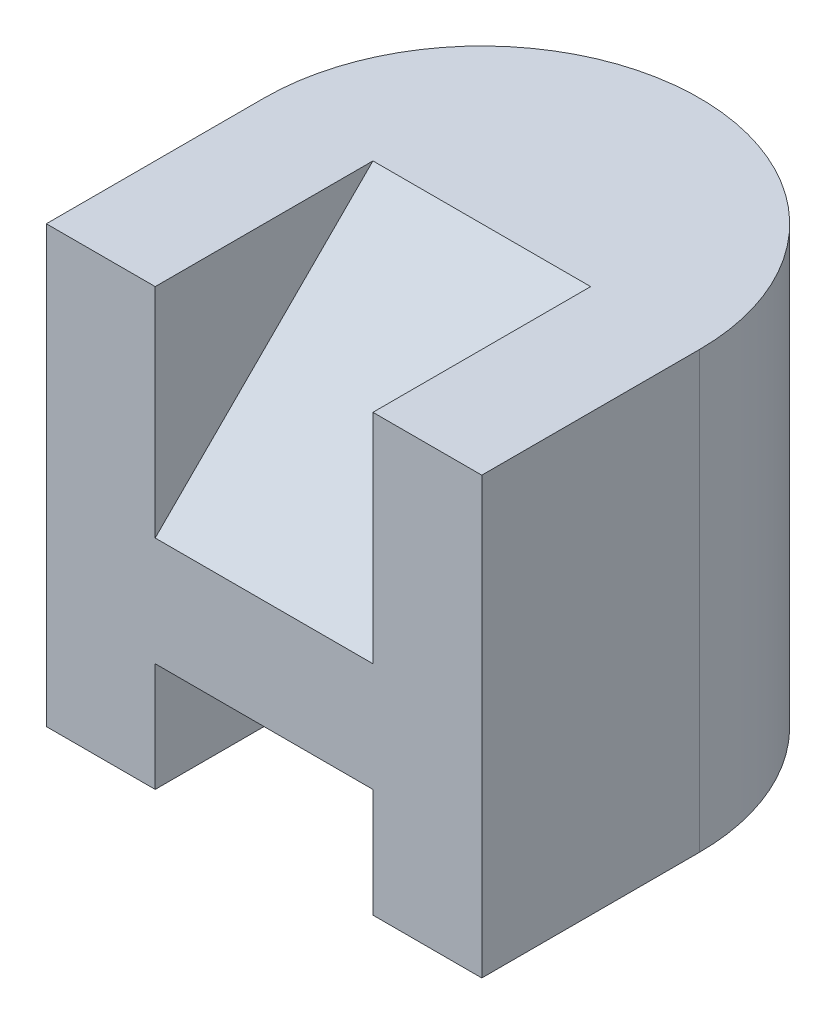
ISO-10303-21;
HEADER;
FILE_DESCRIPTION(('STEP AP214'),'2;1');
FILE_NAME('part.step','',(''),(''),'','','');
FILE_SCHEMA(('AUTOMOTIVE_DESIGN { 1 0 10303 214 1 1 1 1 }'));
ENDSEC;
DATA;
#1=APPLICATION_CONTEXT('core data for automotive mechanical design processes');
#2=APPLICATION_PROTOCOL_DEFINITION('international standard','automotive_design',2000,#1);
#3=PRODUCT_CONTEXT('',#1,'mechanical');
#4=PRODUCT('Part','Part','',(#3));
#5=PRODUCT_RELATED_PRODUCT_CATEGORY('part','',(#4));
#6=PRODUCT_DEFINITION_FORMATION('','',#4);
#7=PRODUCT_DEFINITION_CONTEXT('part definition',#1,'design');
#8=PRODUCT_DEFINITION('design','',#6,#7);
#9=PRODUCT_DEFINITION_SHAPE('','',#8);
#10=(LENGTH_UNIT() NAMED_UNIT(*) SI_UNIT(.MILLI.,.METRE.));
#11=(NAMED_UNIT(*) PLANE_ANGLE_UNIT() SI_UNIT($,.RADIAN.));
#12=(NAMED_UNIT(*) SI_UNIT($,.STERADIAN.) SOLID_ANGLE_UNIT());
#13=UNCERTAINTY_MEASURE_WITH_UNIT(LENGTH_MEASURE(1.E-05),#10,'distance_accuracy_value','');
#14=(GEOMETRIC_REPRESENTATION_CONTEXT(3) GLOBAL_UNCERTAINTY_ASSIGNED_CONTEXT((#13)) GLOBAL_UNIT_ASSIGNED_CONTEXT((#10,
#11,#12)) REPRESENTATION_CONTEXT('',''));
#15=CARTESIAN_POINT('',(0.,0.,0.));
#16=DIRECTION('',(0.,0.,1.));
#17=DIRECTION('',(1.,0.,0.));
#18=AXIS2_PLACEMENT_3D('',#15,#16,#17);
#19=CARTESIAN_POINT('',(2.,4.,2.));
#20=DIRECTION('',(0.,0.,-1.));
#21=DIRECTION('',(-1.,0.,0.));
#22=AXIS2_PLACEMENT_3D('',#19,#20,#21);
#23=PLANE('',#22);
#24=DIRECTION('',(0.,-1.,0.));
#25=VECTOR('',#24,1.);
#26=CARTESIAN_POINT('',(-1.,2.,2.));
#27=LINE('',#26,#25);
#28=CARTESIAN_POINT('',(-1.,4.,2.));
#29=VERTEX_POINT('',#28);
#30=CARTESIAN_POINT('',(-1.,2.,2.));
#31=VERTEX_POINT('',#30);
#32=EDGE_CURVE('E120',#29,#31,#27,.T.);
#33=ORIENTED_EDGE('',*,*,#32,.F.);
#34=DIRECTION('',(1.,0.,0.));
#35=VECTOR('',#34,1.);
#36=CARTESIAN_POINT('',(2.,4.,2.));
#37=LINE('',#36,#35);
#38=CARTESIAN_POINT('',(-2.,4.,2.));
#39=VERTEX_POINT('',#38);
#40=EDGE_CURVE('E132',#39,#29,#37,.T.);
#41=ORIENTED_EDGE('',*,*,#40,.F.);
#42=DIRECTION('',(0.,-1.,0.));
#43=VECTOR('',#42,1.);
#44=CARTESIAN_POINT('',(-2.,4.,2.));
#45=LINE('',#44,#43);
#46=CARTESIAN_POINT('',(-2.,0.,2.));
#47=VERTEX_POINT('',#46);
#48=EDGE_CURVE('E151',#39,#47,#45,.T.);
#49=ORIENTED_EDGE('',*,*,#48,.T.);
#50=DIRECTION('',(1.,0.,0.));
#51=VECTOR('',#50,1.);
#52=CARTESIAN_POINT('',(2.,0.,2.));
#53=LINE('',#52,#51);
#54=CARTESIAN_POINT('',(-1.,0.,2.));
#55=VERTEX_POINT('',#54);
#56=EDGE_CURVE('E152',#47,#55,#53,.T.);
#57=ORIENTED_EDGE('',*,*,#56,.T.);
#58=DIRECTION('',(0.,-1.,0.));
#59=VECTOR('',#58,1.);
#60=CARTESIAN_POINT('',(-1.,0.,2.));
#61=LINE('',#60,#59);
#62=CARTESIAN_POINT('',(-1.,1.,2.));
#63=VERTEX_POINT('',#62);
#64=EDGE_CURVE('E180',#63,#55,#61,.T.);
#65=ORIENTED_EDGE('',*,*,#64,.F.);
#66=DIRECTION('',(-1.,0.,0.));
#67=VECTOR('',#66,1.);
#68=CARTESIAN_POINT('',(-1.,1.,2.));
#69=LINE('',#68,#67);
#70=CARTESIAN_POINT('',(1.,1.,2.));
#71=VERTEX_POINT('',#70);
#72=EDGE_CURVE('E194',#71,#63,#69,.T.);
#73=ORIENTED_EDGE('',*,*,#72,.F.);
#74=DIRECTION('',(0.,1.,0.));
#75=VECTOR('',#74,1.);
#76=CARTESIAN_POINT('',(1.,0.,2.));
#77=LINE('',#76,#75);
#78=CARTESIAN_POINT('',(1.,0.,2.));
#79=VERTEX_POINT('',#78);
#80=EDGE_CURVE('E195',#79,#71,#77,.T.);
#81=ORIENTED_EDGE('',*,*,#80,.F.);
#82=CARTESIAN_POINT('',(2.,0.,2.));
#83=VERTEX_POINT('',#82);
#84=EDGE_CURVE('E156',#79,#83,#53,.T.);
#85=ORIENTED_EDGE('',*,*,#84,.T.);
#86=DIRECTION('',(0.,-1.,0.));
#87=VECTOR('',#86,1.);
#88=CARTESIAN_POINT('',(2.,4.,2.));
#89=LINE('',#88,#87);
#90=CARTESIAN_POINT('',(2.,4.,2.));
#91=VERTEX_POINT('',#90);
#92=EDGE_CURVE('E170',#91,#83,#89,.T.);
#93=ORIENTED_EDGE('',*,*,#92,.F.);
#94=CARTESIAN_POINT('',(1.,4.,2.));
#95=VERTEX_POINT('',#94);
#96=EDGE_CURVE('E140',#95,#91,#37,.T.);
#97=ORIENTED_EDGE('',*,*,#96,.F.);
#98=DIRECTION('',(0.,-1.,0.));
#99=VECTOR('',#98,1.);
#100=CARTESIAN_POINT('',(1.,2.,2.));
#101=LINE('',#100,#99);
#102=CARTESIAN_POINT('',(1.,2.,2.));
#103=VERTEX_POINT('',#102);
#104=EDGE_CURVE('E47',#95,#103,#101,.T.);
#105=ORIENTED_EDGE('',*,*,#104,.T.);
#106=DIRECTION('',(1.,0.,0.));
#107=VECTOR('',#106,1.);
#108=CARTESIAN_POINT('',(-1.,2.,2.));
#109=LINE('',#108,#107);
#110=EDGE_CURVE('E133',#31,#103,#109,.T.);
#111=ORIENTED_EDGE('',*,*,#110,.F.);
#112=EDGE_LOOP('',(#33,#41,#49,#57,#65,#73,#81,#85,#93,#97,#105,#111));
#113=FACE_BOUND('',#112,.T.);
#114=ADVANCED_FACE('F33',(#113),#23,.F.);
#115=CARTESIAN_POINT('',(0.,4.,0.));
#116=DIRECTION('',(0.,-1.,0.));
#117=DIRECTION('',(0.,0.,-1.));
#118=AXIS2_PLACEMENT_3D('',#115,#116,#117);
#119=PLANE('',#118);
#120=DIRECTION('',(0.,0.,1.));
#121=VECTOR('',#120,1.);
#122=CARTESIAN_POINT('',(-1.,4.,2.));
#123=LINE('',#122,#121);
#124=CARTESIAN_POINT('',(-1.,4.,0.));
#125=VERTEX_POINT('',#124);
#126=EDGE_CURVE('E117',#125,#29,#123,.T.);
#127=ORIENTED_EDGE('',*,*,#126,.F.);
#128=DIRECTION('',(1.,0.,0.));
#129=VECTOR('',#128,1.);
#130=CARTESIAN_POINT('',(-1.,4.,0.));
#131=LINE('',#130,#129);
#132=CARTESIAN_POINT('',(1.,4.,0.));
#133=VERTEX_POINT('',#132);
#134=EDGE_CURVE('E196',#125,#133,#131,.T.);
#135=ORIENTED_EDGE('',*,*,#134,.T.);
#136=DIRECTION('',(0.,0.,1.));
#137=VECTOR('',#136,1.);
#138=CARTESIAN_POINT('',(1.,4.,2.));
#139=LINE('',#138,#137);
#140=EDGE_CURVE('E220',#133,#95,#139,.T.);
#141=ORIENTED_EDGE('',*,*,#140,.T.);
#142=ORIENTED_EDGE('',*,*,#96,.T.);
#143=DIRECTION('',(0.,0.,-1.));
#144=VECTOR('',#143,1.);
#145=CARTESIAN_POINT('',(2.,4.,0.));
#146=LINE('',#145,#144);
#147=CARTESIAN_POINT('',(2.,4.,0.));
#148=VERTEX_POINT('',#147);
#149=EDGE_CURVE('E139',#91,#148,#146,.T.);
#150=ORIENTED_EDGE('',*,*,#149,.T.);
#151=CARTESIAN_POINT('',(0.,4.,0.));
#152=DIRECTION('',(0.,1.,0.));
#153=DIRECTION('',(0.,0.,-1.));
#154=AXIS2_PLACEMENT_3D('',#151,#152,#153);
#155=CIRCLE('',#154,2.);
#156=CARTESIAN_POINT('',(-2.,4.,0.));
#157=VERTEX_POINT('',#156);
#158=EDGE_CURVE('E142',#148,#157,#155,.T.);
#159=ORIENTED_EDGE('',*,*,#158,.T.);
#160=DIRECTION('',(0.,0.,1.));
#161=VECTOR('',#160,1.);
#162=CARTESIAN_POINT('',(-2.,4.,2.));
#163=LINE('',#162,#161);
#164=EDGE_CURVE('E137',#157,#39,#163,.T.);
#165=ORIENTED_EDGE('',*,*,#164,.T.);
#166=ORIENTED_EDGE('',*,*,#40,.T.);
#167=EDGE_LOOP('',(#127,#135,#141,#142,#150,#159,#165,#166));
#168=FACE_BOUND('',#167,.T.);
#169=ADVANCED_FACE('F135',(#168),#119,.F.);
#170=CARTESIAN_POINT('',(0.,0.,0.));
#171=DIRECTION('',(0.,-1.,0.));
#172=DIRECTION('',(0.,0.,-1.));
#173=AXIS2_PLACEMENT_3D('',#170,#171,#172);
#174=PLANE('',#173);
#175=DIRECTION('',(0.,0.,-1.));
#176=VECTOR('',#175,1.);
#177=CARTESIAN_POINT('',(-1.,0.,0.));
#178=LINE('',#177,#176);
#179=CARTESIAN_POINT('',(-1.,0.,-1.73205080756888));
#180=VERTEX_POINT('',#179);
#181=EDGE_CURVE('E40',#55,#180,#178,.T.);
#182=ORIENTED_EDGE('',*,*,#181,.F.);
#183=ORIENTED_EDGE('',*,*,#56,.F.);
#184=DIRECTION('',(0.,0.,1.));
#185=VECTOR('',#184,1.);
#186=CARTESIAN_POINT('',(-2.,0.,2.));
#187=LINE('',#186,#185);
#188=CARTESIAN_POINT('',(-2.,0.,0.));
#189=VERTEX_POINT('',#188);
#190=EDGE_CURVE('E144',#189,#47,#187,.T.);
#191=ORIENTED_EDGE('',*,*,#190,.F.);
#192=CARTESIAN_POINT('',(0.,0.,0.));
#193=DIRECTION('',(0.,1.,0.));
#194=DIRECTION('',(0.,0.,-1.));
#195=AXIS2_PLACEMENT_3D('',#192,#193,#194);
#196=CIRCLE('',#195,2.);
#197=EDGE_CURVE('E158',#180,#189,#196,.T.);
#198=ORIENTED_EDGE('',*,*,#197,.F.);
#199=EDGE_LOOP('',(#182,#183,#191,#198));
#200=FACE_BOUND('',#199,.T.);
#201=ADVANCED_FACE('F188',(#200),#174,.T.);
#202=CARTESIAN_POINT('',(2.,4.,0.));
#203=DIRECTION('',(-1.,0.,0.));
#204=DIRECTION('',(0.,0.,1.));
#205=AXIS2_PLACEMENT_3D('',#202,#203,#204);
#206=PLANE('',#205);
#207=DIRECTION('',(0.,0.,-1.));
#208=VECTOR('',#207,1.);
#209=CARTESIAN_POINT('',(2.,0.,0.));
#210=LINE('',#209,#208);
#211=CARTESIAN_POINT('',(2.,0.,0.));
#212=VERTEX_POINT('',#211);
#213=EDGE_CURVE('E155',#83,#212,#210,.T.);
#214=ORIENTED_EDGE('',*,*,#213,.T.);
#215=DIRECTION('',(0.,-1.,0.));
#216=VECTOR('',#215,1.);
#217=CARTESIAN_POINT('',(2.,4.,0.));
#218=LINE('',#217,#216);
#219=EDGE_CURVE('E167',#148,#212,#218,.T.);
#220=ORIENTED_EDGE('',*,*,#219,.F.);
#221=ORIENTED_EDGE('',*,*,#149,.F.);
#222=ORIENTED_EDGE('',*,*,#92,.T.);
#223=EDGE_LOOP('',(#214,#220,#221,#222));
#224=FACE_BOUND('',#223,.T.);
#225=ADVANCED_FACE('F219',(#224),#206,.F.);
#226=CARTESIAN_POINT('',(0.,4.,0.));
#227=DIRECTION('',(0.,-1.,0.));
#228=DIRECTION('',(0.,0.,-1.));
#229=AXIS2_PLACEMENT_3D('',#226,#227,#228);
#230=CYLINDRICAL_SURFACE('',#229,2.);
#231=DIRECTION('',(0.,-1.,0.));
#232=VECTOR('',#231,1.);
#233=CARTESIAN_POINT('',(0.999999999999999,4.,-1.73205080756888));
#234=LINE('',#233,#232);
#235=CARTESIAN_POINT('',(1.,0.,-1.73205080756888));
#236=VERTEX_POINT('',#235);
#237=CARTESIAN_POINT('',(1.,1.,-1.73205080756888));
#238=VERTEX_POINT('',#237);
#239=EDGE_CURVE('E55',#236,#238,#234,.F.);
#240=ORIENTED_EDGE('',*,*,#239,.T.);
#241=CARTESIAN_POINT('',(0.,1.,0.));
#242=DIRECTION('',(0.,1.,0.));
#243=DIRECTION('',(0.,0.,1.));
#244=AXIS2_PLACEMENT_3D('',#241,#242,#243);
#245=CIRCLE('',#244,2.);
#246=CARTESIAN_POINT('',(-1.,1.,-1.73205080756888));
#247=VERTEX_POINT('',#246);
#248=EDGE_CURVE('E11',#238,#247,#245,.T.);
#249=ORIENTED_EDGE('',*,*,#248,.T.);
#250=DIRECTION('',(0.,-1.,0.));
#251=VECTOR('',#250,1.);
#252=CARTESIAN_POINT('',(-1.,4.,-1.73205080756888));
#253=LINE('',#252,#251);
#254=EDGE_CURVE('E146',#247,#180,#253,.T.);
#255=ORIENTED_EDGE('',*,*,#254,.T.);
#256=ORIENTED_EDGE('',*,*,#197,.T.);
#257=DIRECTION('',(0.,-1.,0.));
#258=VECTOR('',#257,1.);
#259=CARTESIAN_POINT('',(-2.,4.,0.));
#260=LINE('',#259,#258);
#261=EDGE_CURVE('E164',#157,#189,#260,.T.);
#262=ORIENTED_EDGE('',*,*,#261,.F.);
#263=ORIENTED_EDGE('',*,*,#158,.F.);
#264=ORIENTED_EDGE('',*,*,#219,.T.);
#265=EDGE_CURVE('E159',#212,#236,#196,.T.);
#266=ORIENTED_EDGE('',*,*,#265,.T.);
#267=EDGE_LOOP('',(#240,#249,#255,#256,#262,#263,#264,#266));
#268=FACE_BOUND('',#267,.T.);
#269=ADVANCED_FACE('F185',(#268),#230,.T.);
#270=CARTESIAN_POINT('',(-2.,4.,2.));
#271=DIRECTION('',(1.,0.,0.));
#272=DIRECTION('',(0.,0.,-1.));
#273=AXIS2_PLACEMENT_3D('',#270,#271,#272);
#274=PLANE('',#273);
#275=ORIENTED_EDGE('',*,*,#190,.T.);
#276=ORIENTED_EDGE('',*,*,#48,.F.);
#277=ORIENTED_EDGE('',*,*,#164,.F.);
#278=ORIENTED_EDGE('',*,*,#261,.T.);
#279=EDGE_LOOP('',(#275,#276,#277,#278));
#280=FACE_BOUND('',#279,.T.);
#281=ADVANCED_FACE('F190',(#280),#274,.F.);
#282=DIRECTION('',(0.,0.,1.));
#283=VECTOR('',#282,1.);
#284=CARTESIAN_POINT('',(1.,0.,0.));
#285=LINE('',#284,#283);
#286=EDGE_CURVE('E173',#236,#79,#285,.T.);
#287=ORIENTED_EDGE('',*,*,#286,.F.);
#288=ORIENTED_EDGE('',*,*,#265,.F.);
#289=ORIENTED_EDGE('',*,*,#213,.F.);
#290=ORIENTED_EDGE('',*,*,#84,.F.);
#291=EDGE_LOOP('',(#287,#288,#289,#290));
#292=FACE_BOUND('',#291,.T.);
#293=ADVANCED_FACE('F212',(#292),#174,.T.);
#294=CARTESIAN_POINT('',(-1.,1.,-2.));
#295=DIRECTION('',(0.,1.,0.));
#296=DIRECTION('',(0.,0.,1.));
#297=AXIS2_PLACEMENT_3D('',#294,#295,#296);
#298=PLANE('',#297);
#299=DIRECTION('',(0.,0.,1.));
#300=VECTOR('',#299,1.);
#301=CARTESIAN_POINT('',(1.,1.,-2.));
#302=LINE('',#301,#300);
#303=EDGE_CURVE('E204',#238,#71,#302,.T.);
#304=ORIENTED_EDGE('',*,*,#303,.T.);
#305=ORIENTED_EDGE('',*,*,#72,.T.);
#306=DIRECTION('',(0.,0.,1.));
#307=VECTOR('',#306,1.);
#308=CARTESIAN_POINT('',(-1.,1.,-2.));
#309=LINE('',#308,#307);
#310=EDGE_CURVE('E205',#247,#63,#309,.T.);
#311=ORIENTED_EDGE('',*,*,#310,.F.);
#312=ORIENTED_EDGE('',*,*,#248,.F.);
#313=EDGE_LOOP('',(#304,#305,#311,#312));
#314=FACE_BOUND('',#313,.T.);
#315=ADVANCED_FACE('F249',(#314),#298,.F.);
#316=CARTESIAN_POINT('',(-1.,0.,-2.));
#317=DIRECTION('',(-1.,0.,0.));
#318=DIRECTION('',(0.,-1.,0.));
#319=AXIS2_PLACEMENT_3D('',#316,#317,#318);
#320=PLANE('',#319);
#321=ORIENTED_EDGE('',*,*,#310,.T.);
#322=ORIENTED_EDGE('',*,*,#64,.T.);
#323=ORIENTED_EDGE('',*,*,#181,.T.);
#324=ORIENTED_EDGE('',*,*,#254,.F.);
#325=EDGE_LOOP('',(#321,#322,#323,#324));
#326=FACE_BOUND('',#325,.T.);
#327=ADVANCED_FACE('F177',(#326),#320,.F.);
#328=CARTESIAN_POINT('',(1.,0.,-2.));
#329=DIRECTION('',(1.,0.,0.));
#330=DIRECTION('',(0.,1.,0.));
#331=AXIS2_PLACEMENT_3D('',#328,#329,#330);
#332=PLANE('',#331);
#333=ORIENTED_EDGE('',*,*,#286,.T.);
#334=ORIENTED_EDGE('',*,*,#80,.T.);
#335=ORIENTED_EDGE('',*,*,#303,.F.);
#336=ORIENTED_EDGE('',*,*,#239,.F.);
#337=EDGE_LOOP('',(#333,#334,#335,#336));
#338=FACE_BOUND('',#337,.T.);
#339=ADVANCED_FACE('F214',(#338),#332,.F.);
#340=CARTESIAN_POINT('',(-1.,4.,0.));
#341=DIRECTION('',(0.,-0.707106781186547,-0.707106781186547));
#342=DIRECTION('',(0.,0.707106781186548,-0.707106781186548));
#343=AXIS2_PLACEMENT_3D('',#340,#341,#342);
#344=PLANE('',#343);
#345=DIRECTION('',(0.,0.707106781186548,-0.707106781186548));
#346=VECTOR('',#345,1.);
#347=CARTESIAN_POINT('',(1.,4.,0.));
#348=LINE('',#347,#346);
#349=EDGE_CURVE('E126',#103,#133,#348,.T.);
#350=ORIENTED_EDGE('',*,*,#349,.T.);
#351=ORIENTED_EDGE('',*,*,#134,.F.);
#352=DIRECTION('',(0.,0.707106781186548,-0.707106781186548));
#353=VECTOR('',#352,1.);
#354=CARTESIAN_POINT('',(-1.,4.,0.));
#355=LINE('',#354,#353);
#356=EDGE_CURVE('E122',#31,#125,#355,.T.);
#357=ORIENTED_EDGE('',*,*,#356,.F.);
#358=ORIENTED_EDGE('',*,*,#110,.T.);
#359=EDGE_LOOP('',(#350,#351,#357,#358));
#360=FACE_BOUND('',#359,.T.);
#361=ADVANCED_FACE('F227',(#360),#344,.F.);
#362=CARTESIAN_POINT('',(-1.,0.,0.));
#363=DIRECTION('',(1.,0.,0.));
#364=DIRECTION('',(0.,0.,-1.));
#365=AXIS2_PLACEMENT_3D('',#362,#363,#364);
#366=PLANE('',#365);
#367=ORIENTED_EDGE('',*,*,#126,.T.);
#368=ORIENTED_EDGE('',*,*,#32,.T.);
#369=ORIENTED_EDGE('',*,*,#356,.T.);
#370=EDGE_LOOP('',(#367,#368,#369));
#371=FACE_BOUND('',#370,.T.);
#372=ADVANCED_FACE('F119',(#371),#366,.T.);
#373=CARTESIAN_POINT('',(1.,0.,0.));
#374=DIRECTION('',(1.,0.,0.));
#375=DIRECTION('',(0.,0.,-1.));
#376=AXIS2_PLACEMENT_3D('',#373,#374,#375);
#377=PLANE('',#376);
#378=ORIENTED_EDGE('',*,*,#140,.F.);
#379=ORIENTED_EDGE('',*,*,#349,.F.);
#380=ORIENTED_EDGE('',*,*,#104,.F.);
#381=EDGE_LOOP('',(#378,#379,#380));
#382=FACE_BOUND('',#381,.T.);
#383=ADVANCED_FACE('F228',(#382),#377,.F.);
#384=CLOSED_SHELL('',(#114,#169,#201,#225,#269,#281,#293,#315,#327,#339,#361,#372,#383));
#385=MANIFOLD_SOLID_BREP('B2',#384);
#386=ADVANCED_BREP_SHAPE_REPRESENTATION('',(#18,#385),#14);
#387=SHAPE_DEFINITION_REPRESENTATION(#9,#386);
ENDSEC;
END-ISO-10303-21;
